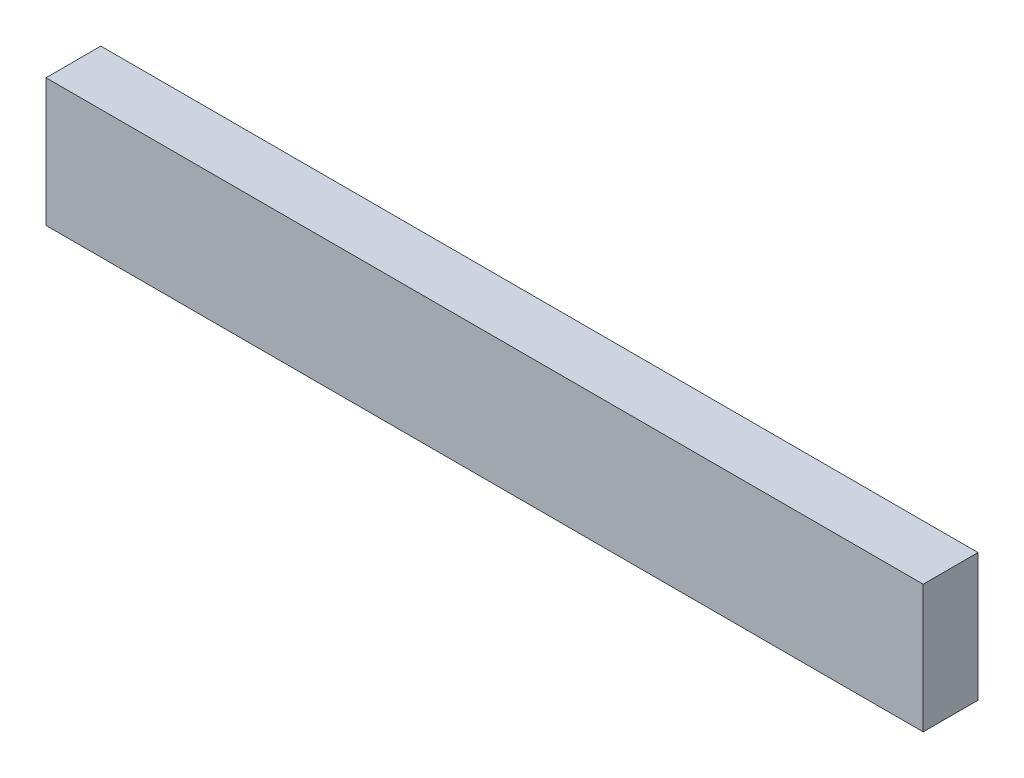
ISO-10303-21;
HEADER;
FILE_DESCRIPTION(('STEP AP214'),'2;1');
FILE_NAME('part.step','',(''),(''),'','','');
FILE_SCHEMA(('AUTOMOTIVE_DESIGN { 1 0 10303 214 1 1 1 1 }'));
ENDSEC;
DATA;
#1=APPLICATION_CONTEXT('core data for automotive mechanical design processes');
#2=APPLICATION_PROTOCOL_DEFINITION('international standard','automotive_design',2000,#1);
#3=PRODUCT_CONTEXT('',#1,'mechanical');
#4=PRODUCT('Part','Part','',(#3));
#5=PRODUCT_RELATED_PRODUCT_CATEGORY('part','',(#4));
#6=PRODUCT_DEFINITION_FORMATION('','',#4);
#7=PRODUCT_DEFINITION_CONTEXT('part definition',#1,'design');
#8=PRODUCT_DEFINITION('design','',#6,#7);
#9=PRODUCT_DEFINITION_SHAPE('','',#8);
#10=(LENGTH_UNIT() NAMED_UNIT(*) SI_UNIT(.MILLI.,.METRE.));
#11=(NAMED_UNIT(*) PLANE_ANGLE_UNIT() SI_UNIT($,.RADIAN.));
#12=(NAMED_UNIT(*) SI_UNIT($,.STERADIAN.) SOLID_ANGLE_UNIT());
#13=UNCERTAINTY_MEASURE_WITH_UNIT(LENGTH_MEASURE(1.E-05),#10,'distance_accuracy_value','');
#14=(GEOMETRIC_REPRESENTATION_CONTEXT(3) GLOBAL_UNCERTAINTY_ASSIGNED_CONTEXT((#13)) GLOBAL_UNIT_ASSIGNED_CONTEXT((#10,
#11,#12)) REPRESENTATION_CONTEXT('',''));
#15=CARTESIAN_POINT('',(0.,0.,0.));
#16=DIRECTION('',(0.,0.,1.));
#17=DIRECTION('',(1.,0.,0.));
#18=AXIS2_PLACEMENT_3D('',#15,#16,#17);
#19=CARTESIAN_POINT('',(609.6,-44.45,-19.05));
#20=DIRECTION('',(0.,0.,1.));
#21=DIRECTION('',(1.,0.,0.));
#22=AXIS2_PLACEMENT_3D('',#19,#20,#21);
#23=PLANE('',#22);
#24=DIRECTION('',(0.,1.,0.));
#25=VECTOR('',#24,1.);
#26=CARTESIAN_POINT('',(0.,-44.45,-19.05));
#27=LINE('',#26,#25);
#28=CARTESIAN_POINT('',(0.,-44.45,-19.05));
#29=VERTEX_POINT('',#28);
#30=CARTESIAN_POINT('',(0.,44.45,-19.05));
#31=VERTEX_POINT('',#30);
#32=EDGE_CURVE('E96',#29,#31,#27,.T.);
#33=ORIENTED_EDGE('',*,*,#32,.T.);
#34=DIRECTION('',(-1.,0.,0.));
#35=VECTOR('',#34,1.);
#36=CARTESIAN_POINT('',(609.6,44.45,-19.05));
#37=LINE('',#36,#35);
#38=CARTESIAN_POINT('',(609.6,44.45,-19.05));
#39=VERTEX_POINT('',#38);
#40=EDGE_CURVE('E11',#39,#31,#37,.T.);
#41=ORIENTED_EDGE('',*,*,#40,.F.);
#42=DIRECTION('',(0.,1.,0.));
#43=VECTOR('',#42,1.);
#44=CARTESIAN_POINT('',(609.6,-44.45,-19.05));
#45=LINE('',#44,#43);
#46=CARTESIAN_POINT('',(609.6,-44.45,-19.05));
#47=VERTEX_POINT('',#46);
#48=EDGE_CURVE('E84',#47,#39,#45,.T.);
#49=ORIENTED_EDGE('',*,*,#48,.F.);
#50=DIRECTION('',(-1.,0.,0.));
#51=VECTOR('',#50,1.);
#52=CARTESIAN_POINT('',(609.6,-44.45,-19.05));
#53=LINE('',#52,#51);
#54=EDGE_CURVE('E92',#47,#29,#53,.T.);
#55=ORIENTED_EDGE('',*,*,#54,.T.);
#56=EDGE_LOOP('',(#33,#41,#49,#55));
#57=FACE_BOUND('',#56,.T.);
#58=ADVANCED_FACE('F33',(#57),#23,.F.);
#59=CARTESIAN_POINT('',(609.6,44.45,19.05));
#60=DIRECTION('',(0.,-1.,0.));
#61=DIRECTION('',(0.,0.,-1.));
#62=AXIS2_PLACEMENT_3D('',#59,#60,#61);
#63=PLANE('',#62);
#64=DIRECTION('',(0.,0.,1.));
#65=VECTOR('',#64,1.);
#66=CARTESIAN_POINT('',(0.,44.45,19.05));
#67=LINE('',#66,#65);
#68=CARTESIAN_POINT('',(0.,44.45,19.05));
#69=VERTEX_POINT('',#68);
#70=EDGE_CURVE('E88',#31,#69,#67,.T.);
#71=ORIENTED_EDGE('',*,*,#70,.T.);
#72=DIRECTION('',(-1.,0.,0.));
#73=VECTOR('',#72,1.);
#74=CARTESIAN_POINT('',(609.6,44.45,19.05));
#75=LINE('',#74,#73);
#76=CARTESIAN_POINT('',(609.6,44.45,19.05));
#77=VERTEX_POINT('',#76);
#78=EDGE_CURVE('E41',#77,#69,#75,.T.);
#79=ORIENTED_EDGE('',*,*,#78,.F.);
#80=DIRECTION('',(0.,0.,1.));
#81=VECTOR('',#80,1.);
#82=CARTESIAN_POINT('',(609.6,44.45,19.05));
#83=LINE('',#82,#81);
#84=EDGE_CURVE('E79',#39,#77,#83,.T.);
#85=ORIENTED_EDGE('',*,*,#84,.F.);
#86=ORIENTED_EDGE('',*,*,#40,.T.);
#87=EDGE_LOOP('',(#71,#79,#85,#86));
#88=FACE_BOUND('',#87,.T.);
#89=ADVANCED_FACE('F87',(#88),#63,.F.);
#90=CARTESIAN_POINT('',(609.6,-44.45,19.05));
#91=DIRECTION('',(0.,0.,-1.));
#92=DIRECTION('',(-1.,0.,0.));
#93=AXIS2_PLACEMENT_3D('',#90,#91,#92);
#94=PLANE('',#93);
#95=DIRECTION('',(0.,-1.,0.));
#96=VECTOR('',#95,1.);
#97=CARTESIAN_POINT('',(0.,-44.45,19.05));
#98=LINE('',#97,#96);
#99=CARTESIAN_POINT('',(0.,-44.45,19.05));
#100=VERTEX_POINT('',#99);
#101=EDGE_CURVE('E66',#69,#100,#98,.T.);
#102=ORIENTED_EDGE('',*,*,#101,.T.);
#103=DIRECTION('',(-1.,0.,0.));
#104=VECTOR('',#103,1.);
#105=CARTESIAN_POINT('',(609.6,-44.45,19.05));
#106=LINE('',#105,#104);
#107=CARTESIAN_POINT('',(609.6,-44.45,19.05));
#108=VERTEX_POINT('',#107);
#109=EDGE_CURVE('E89',#108,#100,#106,.T.);
#110=ORIENTED_EDGE('',*,*,#109,.F.);
#111=DIRECTION('',(0.,-1.,0.));
#112=VECTOR('',#111,1.);
#113=CARTESIAN_POINT('',(609.6,-44.45,19.05));
#114=LINE('',#113,#112);
#115=EDGE_CURVE('E82',#77,#108,#114,.T.);
#116=ORIENTED_EDGE('',*,*,#115,.F.);
#117=ORIENTED_EDGE('',*,*,#78,.T.);
#118=EDGE_LOOP('',(#102,#110,#116,#117));
#119=FACE_BOUND('',#118,.T.);
#120=ADVANCED_FACE('F90',(#119),#94,.F.);
#121=CARTESIAN_POINT('',(609.6,-44.45,19.05));
#122=DIRECTION('',(0.,1.,0.));
#123=DIRECTION('',(0.,0.,1.));
#124=AXIS2_PLACEMENT_3D('',#121,#122,#123);
#125=PLANE('',#124);
#126=DIRECTION('',(0.,0.,-1.));
#127=VECTOR('',#126,1.);
#128=CARTESIAN_POINT('',(0.,-44.45,19.05));
#129=LINE('',#128,#127);
#130=EDGE_CURVE('E72',#100,#29,#129,.T.);
#131=ORIENTED_EDGE('',*,*,#130,.T.);
#132=ORIENTED_EDGE('',*,*,#54,.F.);
#133=DIRECTION('',(0.,0.,-1.));
#134=VECTOR('',#133,1.);
#135=CARTESIAN_POINT('',(609.6,-44.45,19.05));
#136=LINE('',#135,#134);
#137=EDGE_CURVE('E49',#108,#47,#136,.T.);
#138=ORIENTED_EDGE('',*,*,#137,.F.);
#139=ORIENTED_EDGE('',*,*,#109,.T.);
#140=EDGE_LOOP('',(#131,#132,#138,#139));
#141=FACE_BOUND('',#140,.T.);
#142=ADVANCED_FACE('F103',(#141),#125,.F.);
#143=CARTESIAN_POINT('',(609.6,0.,0.));
#144=DIRECTION('',(-1.,0.,0.));
#145=DIRECTION('',(0.,0.,1.));
#146=AXIS2_PLACEMENT_3D('',#143,#144,#145);
#147=PLANE('',#146);
#148=ORIENTED_EDGE('',*,*,#48,.T.);
#149=ORIENTED_EDGE('',*,*,#84,.T.);
#150=ORIENTED_EDGE('',*,*,#115,.T.);
#151=ORIENTED_EDGE('',*,*,#137,.T.);
#152=EDGE_LOOP('',(#148,#149,#150,#151));
#153=FACE_BOUND('',#152,.T.);
#154=ADVANCED_FACE('F80',(#153),#147,.F.);
#155=CARTESIAN_POINT('',(0.,0.,0.));
#156=DIRECTION('',(-1.,0.,0.));
#157=DIRECTION('',(0.,0.,1.));
#158=AXIS2_PLACEMENT_3D('',#155,#156,#157);
#159=PLANE('',#158);
#160=ORIENTED_EDGE('',*,*,#32,.F.);
#161=ORIENTED_EDGE('',*,*,#130,.F.);
#162=ORIENTED_EDGE('',*,*,#101,.F.);
#163=ORIENTED_EDGE('',*,*,#70,.F.);
#164=EDGE_LOOP('',(#160,#161,#162,#163));
#165=FACE_BOUND('',#164,.T.);
#166=ADVANCED_FACE('F106',(#165),#159,.T.);
#167=CLOSED_SHELL('',(#58,#89,#120,#142,#154,#166));
#168=MANIFOLD_SOLID_BREP('B2',#167);
#169=ADVANCED_BREP_SHAPE_REPRESENTATION('',(#18,#168),#14);
#170=SHAPE_DEFINITION_REPRESENTATION(#9,#169);
ENDSEC;
END-ISO-10303-21;
